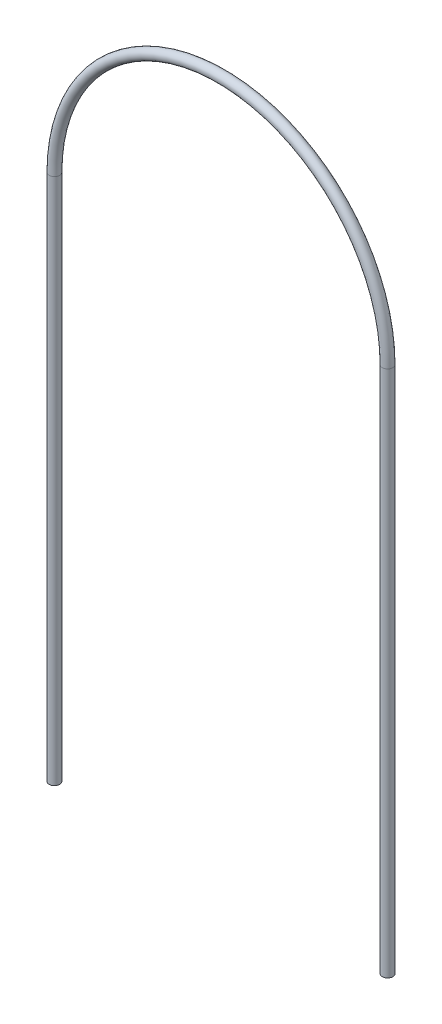
ISO-10303-21;
HEADER;
FILE_DESCRIPTION(('STEP AP214'),'2;1');
FILE_NAME('part.step','',(''),(''),'','','');
FILE_SCHEMA(('AUTOMOTIVE_DESIGN { 1 0 10303 214 1 1 1 1 }'));
ENDSEC;
DATA;
#1=APPLICATION_CONTEXT('core data for automotive mechanical design processes');
#2=APPLICATION_PROTOCOL_DEFINITION('international standard','automotive_design',2000,#1);
#3=PRODUCT_CONTEXT('',#1,'mechanical');
#4=PRODUCT('Part','Part','',(#3));
#5=PRODUCT_RELATED_PRODUCT_CATEGORY('part','',(#4));
#6=PRODUCT_DEFINITION_FORMATION('','',#4);
#7=PRODUCT_DEFINITION_CONTEXT('part definition',#1,'design');
#8=PRODUCT_DEFINITION('design','',#6,#7);
#9=PRODUCT_DEFINITION_SHAPE('','',#8);
#10=(LENGTH_UNIT() NAMED_UNIT(*) SI_UNIT(.MILLI.,.METRE.));
#11=(NAMED_UNIT(*) PLANE_ANGLE_UNIT() SI_UNIT($,.RADIAN.));
#12=(NAMED_UNIT(*) SI_UNIT($,.STERADIAN.) SOLID_ANGLE_UNIT());
#13=UNCERTAINTY_MEASURE_WITH_UNIT(LENGTH_MEASURE(1.E-05),#10,'distance_accuracy_value','');
#14=(GEOMETRIC_REPRESENTATION_CONTEXT(3) GLOBAL_UNCERTAINTY_ASSIGNED_CONTEXT((#13)) GLOBAL_UNIT_ASSIGNED_CONTEXT((#10,
#11,#12)) REPRESENTATION_CONTEXT('',''));
#15=CARTESIAN_POINT('',(0.,0.,0.));
#16=DIRECTION('',(0.,0.,1.));
#17=DIRECTION('',(1.,0.,0.));
#18=AXIS2_PLACEMENT_3D('',#15,#16,#17);
#19=CARTESIAN_POINT('',(76.2,215.9,0.));
#20=DIRECTION('',(0.,0.,-1.));
#21=DIRECTION('',(-1.,0.,0.));
#22=AXIS2_PLACEMENT_3D('',#19,#20,#21);
#23=TOROIDAL_SURFACE('',#22,76.2,2.413);
#24=CARTESIAN_POINT('',(0.,215.9,0.));
#25=DIRECTION('',(0.,1.,0.));
#26=DIRECTION('',(1.,0.,0.));
#27=AXIS2_PLACEMENT_3D('',#24,#25,#26);
#28=CIRCLE('',#27,2.413);
#29=CARTESIAN_POINT('',(-2.41299999999998,215.9,0.));
#30=VERTEX_POINT('',#29);
#31=EDGE_CURVE('E10',#30,#30,#28,.T.);
#32=CARTESIAN_POINT('',(152.4,215.9,0.));
#33=DIRECTION('',(0.,-1.,0.));
#34=DIRECTION('',(-1.,0.,0.));
#35=AXIS2_PLACEMENT_3D('',#32,#33,#34);
#36=CIRCLE('',#35,2.413);
#37=CARTESIAN_POINT('',(154.813,215.9,0.));
#38=VERTEX_POINT('',#37);
#39=EDGE_CURVE('E45',#38,#38,#36,.T.);
#40=CARTESIAN_POINT('',(76.2,215.9,0.));
#41=DIRECTION('',(0.,0.,-1.));
#42=DIRECTION('',(-1.,0.,0.));
#43=AXIS2_PLACEMENT_3D('',#40,#41,#42);
#44=CIRCLE('',#43,78.613);
#45=EDGE_CURVE('',#30,#38,#44,.T.);
#46=ORIENTED_EDGE('',*,*,#31,.T.);
#47=ORIENTED_EDGE('',*,*,#39,.F.);
#48=ORIENTED_EDGE('',*,*,#45,.T.);
#49=ORIENTED_EDGE('',*,*,#45,.F.);
#50=EDGE_LOOP('',(#46,#48,#47,#49));
#51=FACE_BOUND('',#50,.T.);
#52=ADVANCED_FACE('F39',(#51),#23,.T.);
#53=CARTESIAN_POINT('',(152.4,-25.4,0.));
#54=DIRECTION('',(0.,1.,0.));
#55=DIRECTION('',(-1.,0.,0.));
#56=AXIS2_PLACEMENT_3D('',#53,#54,#55);
#57=CYLINDRICAL_SURFACE('',#56,2.413);
#58=CARTESIAN_POINT('',(152.4,-25.4,0.));
#59=DIRECTION('',(0.,-1.,0.));
#60=DIRECTION('',(1.,0.,0.));
#61=AXIS2_PLACEMENT_3D('',#58,#59,#60);
#62=CIRCLE('',#61,2.413);
#63=CARTESIAN_POINT('',(154.813,-25.4,0.));
#64=VERTEX_POINT('',#63);
#65=EDGE_CURVE('E49',#64,#64,#62,.T.);
#66=ORIENTED_EDGE('',*,*,#65,.F.);
#67=EDGE_LOOP('',(#66));
#68=FACE_BOUND('',#67,.T.);
#69=ORIENTED_EDGE('',*,*,#39,.T.);
#70=EDGE_LOOP('',(#69));
#71=FACE_BOUND('',#70,.T.);
#72=ADVANCED_FACE('F71',(#68,#71),#57,.T.);
#73=CARTESIAN_POINT('',(152.4,-25.4,0.));
#74=DIRECTION('',(0.,-1.,0.));
#75=DIRECTION('',(1.,0.,0.));
#76=AXIS2_PLACEMENT_3D('',#73,#74,#75);
#77=PLANE('',#76);
#78=ORIENTED_EDGE('',*,*,#65,.T.);
#79=EDGE_LOOP('',(#78));
#80=FACE_BOUND('',#79,.T.);
#81=ADVANCED_FACE('F64',(#80),#77,.T.);
#82=CARTESIAN_POINT('',(0.,-25.4,0.));
#83=DIRECTION('',(0.,1.,0.));
#84=DIRECTION('',(-1.,0.,0.));
#85=AXIS2_PLACEMENT_3D('',#82,#83,#84);
#86=CYLINDRICAL_SURFACE('',#85,2.413);
#87=CARTESIAN_POINT('',(0.,-25.4,0.));
#88=DIRECTION('',(0.,-1.,0.));
#89=DIRECTION('',(1.,0.,0.));
#90=AXIS2_PLACEMENT_3D('',#87,#88,#89);
#91=CIRCLE('',#90,2.413);
#92=CARTESIAN_POINT('',(2.413,-25.4,0.));
#93=VERTEX_POINT('',#92);
#94=EDGE_CURVE('E53',#93,#93,#91,.T.);
#95=ORIENTED_EDGE('',*,*,#94,.F.);
#96=EDGE_LOOP('',(#95));
#97=FACE_BOUND('',#96,.T.);
#98=ORIENTED_EDGE('',*,*,#31,.F.);
#99=EDGE_LOOP('',(#98));
#100=FACE_BOUND('',#99,.T.);
#101=ADVANCED_FACE('F61',(#97,#100),#86,.T.);
#102=CARTESIAN_POINT('',(0.,-25.4,0.));
#103=DIRECTION('',(0.,-1.,0.));
#104=DIRECTION('',(1.,0.,0.));
#105=AXIS2_PLACEMENT_3D('',#102,#103,#104);
#106=PLANE('',#105);
#107=ORIENTED_EDGE('',*,*,#94,.T.);
#108=EDGE_LOOP('',(#107));
#109=FACE_BOUND('',#108,.T.);
#110=ADVANCED_FACE('F59',(#109),#106,.T.);
#111=CLOSED_SHELL('',(#52,#72,#81,#101,#110));
#112=MANIFOLD_SOLID_BREP('B2',#111);
#113=ADVANCED_BREP_SHAPE_REPRESENTATION('',(#18,#112),#14);
#114=SHAPE_DEFINITION_REPRESENTATION(#9,#113);
ENDSEC;
END-ISO-10303-21;
